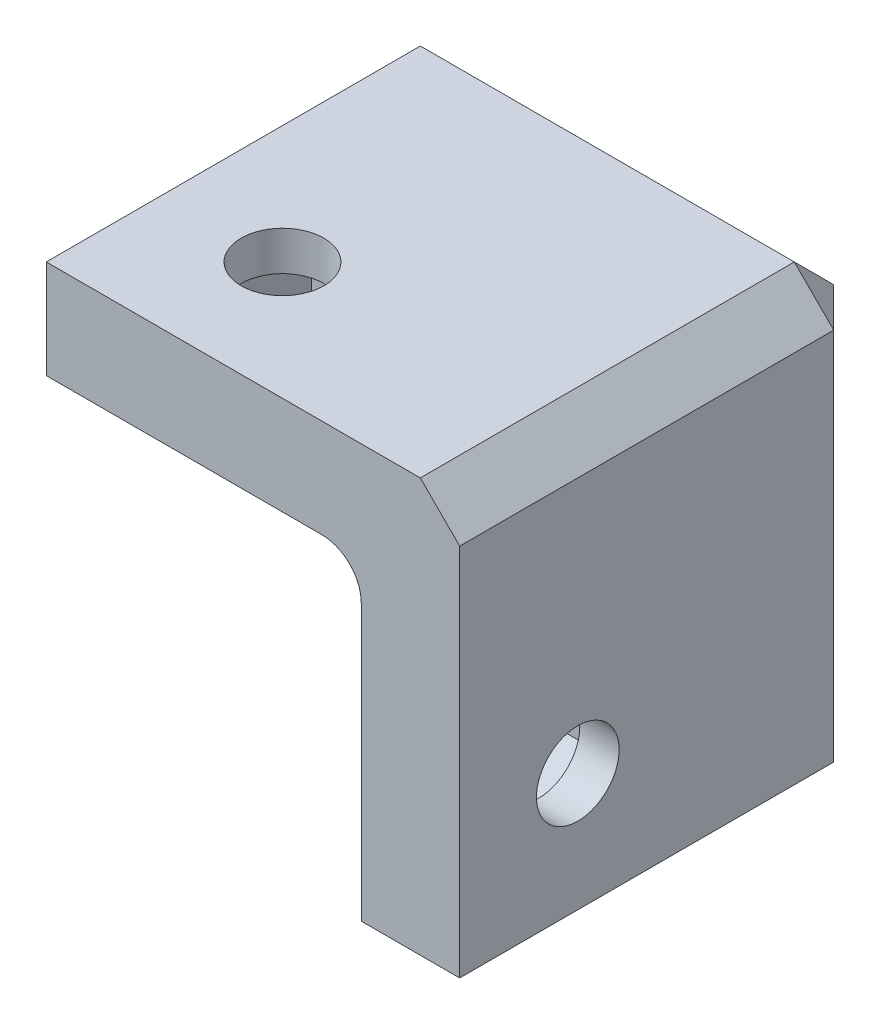
ISO-10303-21;
HEADER;
FILE_DESCRIPTION(('STEP AP214'),'2;1');
FILE_NAME('part.step','',(''),(''),'','','');
FILE_SCHEMA(('AUTOMOTIVE_DESIGN { 1 0 10303 214 1 1 1 1 }'));
ENDSEC;
DATA;
#1=APPLICATION_CONTEXT('core data for automotive mechanical design processes');
#2=APPLICATION_PROTOCOL_DEFINITION('international standard','automotive_design',2000,#1);
#3=PRODUCT_CONTEXT('',#1,'mechanical');
#4=PRODUCT('Part','Part','',(#3));
#5=PRODUCT_RELATED_PRODUCT_CATEGORY('part','',(#4));
#6=PRODUCT_DEFINITION_FORMATION('','',#4);
#7=PRODUCT_DEFINITION_CONTEXT('part definition',#1,'design');
#8=PRODUCT_DEFINITION('design','',#6,#7);
#9=PRODUCT_DEFINITION_SHAPE('','',#8);
#10=(LENGTH_UNIT() NAMED_UNIT(*) SI_UNIT(.MILLI.,.METRE.));
#11=(NAMED_UNIT(*) PLANE_ANGLE_UNIT() SI_UNIT($,.RADIAN.));
#12=(NAMED_UNIT(*) SI_UNIT($,.STERADIAN.) SOLID_ANGLE_UNIT());
#13=UNCERTAINTY_MEASURE_WITH_UNIT(LENGTH_MEASURE(1.E-05),#10,'distance_accuracy_value','');
#14=(GEOMETRIC_REPRESENTATION_CONTEXT(3) GLOBAL_UNCERTAINTY_ASSIGNED_CONTEXT((#13)) GLOBAL_UNIT_ASSIGNED_CONTEXT((#10,
#11,#12)) REPRESENTATION_CONTEXT('',''));
#15=CARTESIAN_POINT('',(0.,0.,0.));
#16=DIRECTION('',(0.,0.,1.));
#17=DIRECTION('',(1.,0.,0.));
#18=AXIS2_PLACEMENT_3D('',#15,#16,#17);
#19=CARTESIAN_POINT('',(6.,18.,15.));
#20=DIRECTION('',(0.,1.,0.));
#21=DIRECTION('',(0.,0.,1.));
#22=AXIS2_PLACEMENT_3D('',#19,#20,#21);
#23=CYLINDRICAL_SURFACE('',#22,2.1);
#24=CARTESIAN_POINT('',(6.,21.,15.));
#25=DIRECTION('',(0.,1.,0.));
#26=DIRECTION('',(0.,0.,1.));
#27=AXIS2_PLACEMENT_3D('',#24,#25,#26);
#28=CIRCLE('',#27,2.1);
#29=CARTESIAN_POINT('',(6.,21.,17.1));
#30=VERTEX_POINT('',#29);
#31=EDGE_CURVE('E397',#30,#30,#28,.T.);
#32=ORIENTED_EDGE('',*,*,#31,.T.);
#33=EDGE_LOOP('',(#32));
#34=FACE_BOUND('',#33,.T.);
#35=CARTESIAN_POINT('',(6.,19.,15.));
#36=DIRECTION('',(0.,-1.,0.));
#37=DIRECTION('',(0.,0.,-1.));
#38=AXIS2_PLACEMENT_3D('',#35,#36,#37);
#39=CIRCLE('',#38,2.1);
#40=CARTESIAN_POINT('',(6.,19.,12.9));
#41=VERTEX_POINT('',#40);
#42=EDGE_CURVE('E285',#41,#41,#39,.F.);
#43=ORIENTED_EDGE('',*,*,#42,.F.);
#44=EDGE_LOOP('',(#43));
#45=FACE_BOUND('',#44,.T.);
#46=ADVANCED_FACE('F34',(#34,#45),#23,.F.);
#47=CARTESIAN_POINT('',(6.,6.,3.));
#48=DIRECTION('',(0.,0.,-1.));
#49=DIRECTION('',(-1.,0.,0.));
#50=AXIS2_PLACEMENT_3D('',#47,#48,#49);
#51=CYLINDRICAL_SURFACE('',#50,2.1);
#52=CARTESIAN_POINT('',(6.,6.,0.));
#53=DIRECTION('',(0.,0.,-1.));
#54=DIRECTION('',(-1.,0.,0.));
#55=AXIS2_PLACEMENT_3D('',#52,#53,#54);
#56=CIRCLE('',#55,2.1);
#57=CARTESIAN_POINT('',(3.9,6.,0.));
#58=VERTEX_POINT('',#57);
#59=EDGE_CURVE('E391',#58,#58,#56,.T.);
#60=ORIENTED_EDGE('',*,*,#59,.T.);
#61=EDGE_LOOP('',(#60));
#62=FACE_BOUND('',#61,.T.);
#63=CARTESIAN_POINT('',(6.,6.,2.));
#64=DIRECTION('',(0.,0.,1.));
#65=DIRECTION('',(1.,0.,0.));
#66=AXIS2_PLACEMENT_3D('',#63,#64,#65);
#67=CIRCLE('',#66,2.1);
#68=CARTESIAN_POINT('',(8.1,6.,2.));
#69=VERTEX_POINT('',#68);
#70=EDGE_CURVE('E331',#69,#69,#67,.F.);
#71=ORIENTED_EDGE('',*,*,#70,.F.);
#72=EDGE_LOOP('',(#71));
#73=FACE_BOUND('',#72,.T.);
#74=ADVANCED_FACE('F544',(#62,#73),#51,.F.);
#75=CARTESIAN_POINT('',(18.,6.,15.));
#76=DIRECTION('',(1.,0.,0.));
#77=DIRECTION('',(0.,0.,-1.));
#78=AXIS2_PLACEMENT_3D('',#75,#76,#77);
#79=CYLINDRICAL_SURFACE('',#78,2.1);
#80=CARTESIAN_POINT('',(21.,6.,15.));
#81=DIRECTION('',(1.,0.,0.));
#82=DIRECTION('',(0.,0.,-1.));
#83=AXIS2_PLACEMENT_3D('',#80,#81,#82);
#84=CIRCLE('',#83,2.1);
#85=CARTESIAN_POINT('',(21.,6.,12.9));
#86=VERTEX_POINT('',#85);
#87=EDGE_CURVE('E394',#86,#86,#84,.T.);
#88=ORIENTED_EDGE('',*,*,#87,.T.);
#89=EDGE_LOOP('',(#88));
#90=FACE_BOUND('',#89,.T.);
#91=CARTESIAN_POINT('',(19.,6.,15.));
#92=DIRECTION('',(-1.,0.,0.));
#93=DIRECTION('',(0.,0.,1.));
#94=AXIS2_PLACEMENT_3D('',#91,#92,#93);
#95=CIRCLE('',#94,2.1);
#96=CARTESIAN_POINT('',(19.,6.,17.1));
#97=VERTEX_POINT('',#96);
#98=EDGE_CURVE('E380',#97,#97,#95,.F.);
#99=ORIENTED_EDGE('',*,*,#98,.F.);
#100=EDGE_LOOP('',(#99));
#101=FACE_BOUND('',#100,.T.);
#102=ADVANCED_FACE('F550',(#90,#101),#79,.F.);
#103=CARTESIAN_POINT('',(0.,0.,5.));
#104=DIRECTION('',(0.,0.,-1.));
#105=DIRECTION('',(-1.,0.,0.));
#106=AXIS2_PLACEMENT_3D('',#103,#104,#105);
#107=PLANE('',#106);
#108=DIRECTION('',(0.,1.,0.));
#109=VECTOR('',#108,1.);
#110=CARTESIAN_POINT('',(9.50000000000001,3.97927405783631,5.));
#111=LINE('',#110,#109);
#112=CARTESIAN_POINT('',(9.50000000000001,3.97927405783631,5.));
#113=VERTEX_POINT('',#112);
#114=CARTESIAN_POINT('',(9.50000000000001,8.0207259421637,5.));
#115=VERTEX_POINT('',#114);
#116=EDGE_CURVE('E315',#113,#115,#111,.T.);
#117=ORIENTED_EDGE('',*,*,#116,.F.);
#118=DIRECTION('',(0.866025403784439,0.5,0.));
#119=VECTOR('',#118,1.);
#120=CARTESIAN_POINT('',(6.00000000000001,1.95854811567261,5.));
#121=LINE('',#120,#119);
#122=CARTESIAN_POINT('',(6.00000000000001,1.95854811567261,5.));
#123=VERTEX_POINT('',#122);
#124=EDGE_CURVE('E313',#123,#113,#121,.T.);
#125=ORIENTED_EDGE('',*,*,#124,.F.);
#126=DIRECTION('',(0.866025403784438,-0.5,0.));
#127=VECTOR('',#126,1.);
#128=CARTESIAN_POINT('',(2.5,3.97927405783631,5.));
#129=LINE('',#128,#127);
#130=CARTESIAN_POINT('',(2.5,3.97927405783631,5.));
#131=VERTEX_POINT('',#130);
#132=EDGE_CURVE('E297',#131,#123,#129,.T.);
#133=ORIENTED_EDGE('',*,*,#132,.F.);
#134=DIRECTION('',(0.,-1.,0.));
#135=VECTOR('',#134,1.);
#136=CARTESIAN_POINT('',(2.5,8.0207259421637,5.));
#137=LINE('',#136,#135);
#138=CARTESIAN_POINT('',(2.5,8.0207259421637,5.));
#139=VERTEX_POINT('',#138);
#140=EDGE_CURVE('E324',#139,#131,#137,.T.);
#141=ORIENTED_EDGE('',*,*,#140,.F.);
#142=DIRECTION('',(-0.866025403784439,-0.499999999999999,0.));
#143=VECTOR('',#142,1.);
#144=CARTESIAN_POINT('',(6.00000000000001,10.0414518843274,5.));
#145=LINE('',#144,#143);
#146=CARTESIAN_POINT('',(6.00000000000001,10.0414518843274,5.));
#147=VERTEX_POINT('',#146);
#148=EDGE_CURVE('E321',#147,#139,#145,.T.);
#149=ORIENTED_EDGE('',*,*,#148,.F.);
#150=DIRECTION('',(-0.866025403784439,0.5,0.));
#151=VECTOR('',#150,1.);
#152=CARTESIAN_POINT('',(9.50000000000001,8.0207259421637,5.));
#153=LINE('',#152,#151);
#154=EDGE_CURVE('E318',#115,#147,#153,.T.);
#155=ORIENTED_EDGE('',*,*,#154,.F.);
#156=EDGE_LOOP('',(#117,#125,#133,#141,#149,#155));
#157=FACE_BOUND('',#156,.T.);
#158=DIRECTION('',(0.,-1.,0.));
#159=VECTOR('',#158,1.);
#160=CARTESIAN_POINT('',(14.,16.,5.));
#161=LINE('',#160,#159);
#162=CARTESIAN_POINT('',(14.,0.,5.));
#163=VERTEX_POINT('',#162);
#164=CARTESIAN_POINT('',(14.,14.,5.));
#165=VERTEX_POINT('',#164);
#166=EDGE_CURVE('E428',#163,#165,#161,.F.);
#167=ORIENTED_EDGE('',*,*,#166,.T.);
#168=DIRECTION('',(1.,0.,0.));
#169=VECTOR('',#168,1.);
#170=CARTESIAN_POINT('',(0.,14.,5.));
#171=LINE('',#170,#169);
#172=CARTESIAN_POINT('',(0.,14.,5.));
#173=VERTEX_POINT('',#172);
#174=EDGE_CURVE('E430',#165,#173,#171,.F.);
#175=ORIENTED_EDGE('',*,*,#174,.T.);
#176=DIRECTION('',(0.,-1.,0.));
#177=VECTOR('',#176,1.);
#178=CARTESIAN_POINT('',(0.,0.,5.));
#179=LINE('',#178,#177);
#180=CARTESIAN_POINT('',(0.,0.,5.));
#181=VERTEX_POINT('',#180);
#182=EDGE_CURVE('E421',#173,#181,#179,.T.);
#183=ORIENTED_EDGE('',*,*,#182,.T.);
#184=DIRECTION('',(1.,0.,0.));
#185=VECTOR('',#184,1.);
#186=CARTESIAN_POINT('',(0.,0.,5.));
#187=LINE('',#186,#185);
#188=EDGE_CURVE('E424',#181,#163,#187,.T.);
#189=ORIENTED_EDGE('',*,*,#188,.T.);
#190=EDGE_LOOP('',(#167,#175,#183,#189));
#191=FACE_BOUND('',#190,.T.);
#192=ADVANCED_FACE('F527',(#157,#191),#107,.F.);
#193=CARTESIAN_POINT('',(0.,0.,5.));
#194=DIRECTION('',(1.,0.,0.));
#195=DIRECTION('',(0.,0.,-1.));
#196=AXIS2_PLACEMENT_3D('',#193,#194,#195);
#197=PLANE('',#196);
#198=DIRECTION('',(0.,0.,-1.));
#199=VECTOR('',#198,1.);
#200=CARTESIAN_POINT('',(0.,21.,5.));
#201=LINE('',#200,#199);
#202=CARTESIAN_POINT('',(0.,21.,21.));
#203=VERTEX_POINT('',#202);
#204=CARTESIAN_POINT('',(0.,21.,2.));
#205=VERTEX_POINT('',#204);
#206=EDGE_CURVE('E508',#203,#205,#201,.T.);
#207=ORIENTED_EDGE('',*,*,#206,.T.);
#208=DIRECTION('',(0.,-0.707106781186548,-0.707106781186547));
#209=VECTOR('',#208,1.);
#210=CARTESIAN_POINT('',(0.,21.,2.));
#211=LINE('',#210,#209);
#212=CARTESIAN_POINT('',(0.,19.,0.));
#213=VERTEX_POINT('',#212);
#214=EDGE_CURVE('E474',#205,#213,#211,.T.);
#215=ORIENTED_EDGE('',*,*,#214,.T.);
#216=DIRECTION('',(0.,-1.,0.));
#217=VECTOR('',#216,1.);
#218=CARTESIAN_POINT('',(0.,0.,0.));
#219=LINE('',#218,#217);
#220=CARTESIAN_POINT('',(0.,0.,0.));
#221=VERTEX_POINT('',#220);
#222=EDGE_CURVE('E505',#213,#221,#219,.T.);
#223=ORIENTED_EDGE('',*,*,#222,.T.);
#224=DIRECTION('',(0.,0.,-1.));
#225=VECTOR('',#224,1.);
#226=CARTESIAN_POINT('',(0.,0.,5.));
#227=LINE('',#226,#225);
#228=EDGE_CURVE('E489',#181,#221,#227,.T.);
#229=ORIENTED_EDGE('',*,*,#228,.F.);
#230=ORIENTED_EDGE('',*,*,#182,.F.);
#231=CARTESIAN_POINT('',(0.,14.,7.));
#232=DIRECTION('',(1.,0.,0.));
#233=DIRECTION('',(0.,0.,-1.));
#234=AXIS2_PLACEMENT_3D('',#231,#232,#233);
#235=CIRCLE('',#234,2.);
#236=CARTESIAN_POINT('',(0.,16.,7.));
#237=VERTEX_POINT('',#236);
#238=EDGE_CURVE('E435',#173,#237,#235,.T.);
#239=ORIENTED_EDGE('',*,*,#238,.T.);
#240=DIRECTION('',(0.,0.,-1.));
#241=VECTOR('',#240,1.);
#242=CARTESIAN_POINT('',(0.,16.,21.));
#243=LINE('',#242,#241);
#244=CARTESIAN_POINT('',(0.,16.,21.));
#245=VERTEX_POINT('',#244);
#246=EDGE_CURVE('E500',#245,#237,#243,.T.);
#247=ORIENTED_EDGE('',*,*,#246,.F.);
#248=DIRECTION('',(0.,-1.,0.));
#249=VECTOR('',#248,1.);
#250=CARTESIAN_POINT('',(0.,21.,21.));
#251=LINE('',#250,#249);
#252=EDGE_CURVE('E400',#203,#245,#251,.T.);
#253=ORIENTED_EDGE('',*,*,#252,.F.);
#254=EDGE_LOOP('',(#207,#215,#223,#229,#230,#239,#247,#253));
#255=FACE_BOUND('',#254,.T.);
#256=ADVANCED_FACE('F518',(#255),#197,.F.);
#257=CARTESIAN_POINT('',(0.,0.,5.));
#258=DIRECTION('',(0.,1.,0.));
#259=DIRECTION('',(0.,0.,1.));
#260=AXIS2_PLACEMENT_3D('',#257,#258,#259);
#261=PLANE('',#260);
#262=DIRECTION('',(1.,0.,0.));
#263=VECTOR('',#262,1.);
#264=CARTESIAN_POINT('',(0.,0.,0.));
#265=LINE('',#264,#263);
#266=CARTESIAN_POINT('',(19.,0.,0.));
#267=VERTEX_POINT('',#266);
#268=EDGE_CURVE('E425',#221,#267,#265,.T.);
#269=ORIENTED_EDGE('',*,*,#268,.T.);
#270=DIRECTION('',(0.707106781186548,0.,0.707106781186547));
#271=VECTOR('',#270,1.);
#272=CARTESIAN_POINT('',(21.,0.,2.));
#273=LINE('',#272,#271);
#274=CARTESIAN_POINT('',(21.,0.,2.));
#275=VERTEX_POINT('',#274);
#276=EDGE_CURVE('E458',#267,#275,#273,.T.);
#277=ORIENTED_EDGE('',*,*,#276,.T.);
#278=DIRECTION('',(0.,0.,-1.));
#279=VECTOR('',#278,1.);
#280=CARTESIAN_POINT('',(21.,0.,5.));
#281=LINE('',#280,#279);
#282=CARTESIAN_POINT('',(21.,0.,21.));
#283=VERTEX_POINT('',#282);
#284=EDGE_CURVE('E511',#283,#275,#281,.T.);
#285=ORIENTED_EDGE('',*,*,#284,.F.);
#286=DIRECTION('',(1.,0.,0.));
#287=VECTOR('',#286,1.);
#288=CARTESIAN_POINT('',(21.,0.,21.));
#289=LINE('',#288,#287);
#290=CARTESIAN_POINT('',(16.,0.,21.));
#291=VERTEX_POINT('',#290);
#292=EDGE_CURVE('E407',#291,#283,#289,.T.);
#293=ORIENTED_EDGE('',*,*,#292,.F.);
#294=DIRECTION('',(0.,0.,-1.));
#295=VECTOR('',#294,1.);
#296=CARTESIAN_POINT('',(16.,0.,21.));
#297=LINE('',#296,#295);
#298=CARTESIAN_POINT('',(16.,0.,7.));
#299=VERTEX_POINT('',#298);
#300=EDGE_CURVE('E415',#291,#299,#297,.T.);
#301=ORIENTED_EDGE('',*,*,#300,.T.);
#302=CARTESIAN_POINT('',(14.,0.,7.));
#303=DIRECTION('',(0.,1.,0.));
#304=DIRECTION('',(0.,0.,1.));
#305=AXIS2_PLACEMENT_3D('',#302,#303,#304);
#306=CIRCLE('',#305,2.);
#307=EDGE_CURVE('E43',#299,#163,#306,.T.);
#308=ORIENTED_EDGE('',*,*,#307,.T.);
#309=ORIENTED_EDGE('',*,*,#188,.F.);
#310=ORIENTED_EDGE('',*,*,#228,.T.);
#311=EDGE_LOOP('',(#269,#277,#285,#293,#301,#308,#309,#310));
#312=FACE_BOUND('',#311,.T.);
#313=ADVANCED_FACE('F523',(#312),#261,.F.);
#314=CARTESIAN_POINT('',(21.,0.,5.));
#315=DIRECTION('',(-1.,0.,0.));
#316=DIRECTION('',(0.,0.,1.));
#317=AXIS2_PLACEMENT_3D('',#314,#315,#316);
#318=PLANE('',#317);
#319=ORIENTED_EDGE('',*,*,#87,.F.);
#320=EDGE_LOOP('',(#319));
#321=FACE_BOUND('',#320,.T.);
#322=DIRECTION('',(0.,1.,0.));
#323=VECTOR('',#322,1.);
#324=CARTESIAN_POINT('',(21.,21.,2.));
#325=LINE('',#324,#323);
#326=CARTESIAN_POINT('',(21.,19.,2.));
#327=VERTEX_POINT('',#326);
#328=EDGE_CURVE('E482',#275,#327,#325,.T.);
#329=ORIENTED_EDGE('',*,*,#328,.T.);
#330=DIRECTION('',(0.,0.,1.));
#331=VECTOR('',#330,1.);
#332=CARTESIAN_POINT('',(21.,19.,5.));
#333=LINE('',#332,#331);
#334=CARTESIAN_POINT('',(21.,19.,21.));
#335=VERTEX_POINT('',#334);
#336=EDGE_CURVE('E480',#327,#335,#333,.T.);
#337=ORIENTED_EDGE('',*,*,#336,.T.);
#338=DIRECTION('',(0.,1.,0.));
#339=VECTOR('',#338,1.);
#340=CARTESIAN_POINT('',(21.,21.,21.));
#341=LINE('',#340,#339);
#342=EDGE_CURVE('E410',#283,#335,#341,.T.);
#343=ORIENTED_EDGE('',*,*,#342,.F.);
#344=ORIENTED_EDGE('',*,*,#284,.T.);
#345=EDGE_LOOP('',(#329,#337,#343,#344));
#346=FACE_BOUND('',#345,.T.);
#347=ADVANCED_FACE('F577',(#321,#346),#318,.F.);
#348=CARTESIAN_POINT('',(0.,21.,5.));
#349=DIRECTION('',(0.,-1.,0.));
#350=DIRECTION('',(0.,0.,-1.));
#351=AXIS2_PLACEMENT_3D('',#348,#349,#350);
#352=PLANE('',#351);
#353=ORIENTED_EDGE('',*,*,#31,.F.);
#354=EDGE_LOOP('',(#353));
#355=FACE_BOUND('',#354,.T.);
#356=DIRECTION('',(-1.,0.,0.));
#357=VECTOR('',#356,1.);
#358=CARTESIAN_POINT('',(0.,21.,21.));
#359=LINE('',#358,#357);
#360=CARTESIAN_POINT('',(19.,21.,21.));
#361=VERTEX_POINT('',#360);
#362=EDGE_CURVE('E413',#361,#203,#359,.T.);
#363=ORIENTED_EDGE('',*,*,#362,.F.);
#364=DIRECTION('',(0.,0.,-1.));
#365=VECTOR('',#364,1.);
#366=CARTESIAN_POINT('',(19.,21.,5.));
#367=LINE('',#366,#365);
#368=CARTESIAN_POINT('',(19.,21.,2.));
#369=VERTEX_POINT('',#368);
#370=EDGE_CURVE('E484',#361,#369,#367,.T.);
#371=ORIENTED_EDGE('',*,*,#370,.T.);
#372=DIRECTION('',(-1.,0.,0.));
#373=VECTOR('',#372,1.);
#374=CARTESIAN_POINT('',(0.,21.,2.));
#375=LINE('',#374,#373);
#376=EDGE_CURVE('E487',#369,#205,#375,.T.);
#377=ORIENTED_EDGE('',*,*,#376,.T.);
#378=ORIENTED_EDGE('',*,*,#206,.F.);
#379=EDGE_LOOP('',(#363,#371,#377,#378));
#380=FACE_BOUND('',#379,.T.);
#381=ADVANCED_FACE('F573',(#355,#380),#352,.F.);
#382=CARTESIAN_POINT('',(0.,0.,0.));
#383=DIRECTION('',(0.,0.,-1.));
#384=DIRECTION('',(-1.,0.,0.));
#385=AXIS2_PLACEMENT_3D('',#382,#383,#384);
#386=PLANE('',#385);
#387=ORIENTED_EDGE('',*,*,#59,.F.);
#388=EDGE_LOOP('',(#387));
#389=FACE_BOUND('',#388,.T.);
#390=ORIENTED_EDGE('',*,*,#222,.F.);
#391=DIRECTION('',(1.,0.,0.));
#392=VECTOR('',#391,1.);
#393=CARTESIAN_POINT('',(21.,19.,0.));
#394=LINE('',#393,#392);
#395=CARTESIAN_POINT('',(19.,19.,0.));
#396=VERTEX_POINT('',#395);
#397=EDGE_CURVE('E464',#213,#396,#394,.T.);
#398=ORIENTED_EDGE('',*,*,#397,.T.);
#399=DIRECTION('',(0.,-1.,0.));
#400=VECTOR('',#399,1.);
#401=CARTESIAN_POINT('',(19.,0.,0.));
#402=LINE('',#401,#400);
#403=EDGE_CURVE('E469',#396,#267,#402,.T.);
#404=ORIENTED_EDGE('',*,*,#403,.T.);
#405=ORIENTED_EDGE('',*,*,#268,.F.);
#406=EDGE_LOOP('',(#390,#398,#404,#405));
#407=FACE_BOUND('',#406,.T.);
#408=ADVANCED_FACE('F521',(#389,#407),#386,.T.);
#409=CARTESIAN_POINT('',(0.,16.,21.));
#410=DIRECTION('',(0.,1.,0.));
#411=DIRECTION('',(0.,0.,1.));
#412=AXIS2_PLACEMENT_3D('',#409,#410,#411);
#413=PLANE('',#412);
#414=DIRECTION('',(0.5,0.,0.866025403784438));
#415=VECTOR('',#414,1.);
#416=CARTESIAN_POINT('',(8.0207259421637,16.,11.5));
#417=LINE('',#416,#415);
#418=CARTESIAN_POINT('',(8.0207259421637,16.,11.5));
#419=VERTEX_POINT('',#418);
#420=CARTESIAN_POINT('',(10.0414518843274,16.,15.));
#421=VERTEX_POINT('',#420);
#422=EDGE_CURVE('E272',#419,#421,#417,.T.);
#423=ORIENTED_EDGE('',*,*,#422,.F.);
#424=DIRECTION('',(1.,0.,0.));
#425=VECTOR('',#424,1.);
#426=CARTESIAN_POINT('',(3.97927405783632,16.,11.5));
#427=LINE('',#426,#425);
#428=CARTESIAN_POINT('',(3.97927405783632,16.,11.5));
#429=VERTEX_POINT('',#428);
#430=EDGE_CURVE('E239',#429,#419,#427,.T.);
#431=ORIENTED_EDGE('',*,*,#430,.F.);
#432=DIRECTION('',(0.499999999999999,0.,-0.866025403784439));
#433=VECTOR('',#432,1.);
#434=CARTESIAN_POINT('',(1.95854811567262,16.,15.));
#435=LINE('',#434,#433);
#436=CARTESIAN_POINT('',(1.95854811567262,16.,15.));
#437=VERTEX_POINT('',#436);
#438=EDGE_CURVE('E258',#437,#429,#435,.T.);
#439=ORIENTED_EDGE('',*,*,#438,.F.);
#440=DIRECTION('',(-0.5,0.,-0.866025403784438));
#441=VECTOR('',#440,1.);
#442=CARTESIAN_POINT('',(3.97927405783632,16.,18.5));
#443=LINE('',#442,#441);
#444=CARTESIAN_POINT('',(3.97927405783632,16.,18.5));
#445=VERTEX_POINT('',#444);
#446=EDGE_CURVE('E261',#445,#437,#443,.T.);
#447=ORIENTED_EDGE('',*,*,#446,.F.);
#448=DIRECTION('',(-1.,0.,0.));
#449=VECTOR('',#448,1.);
#450=CARTESIAN_POINT('',(8.0207259421637,16.,18.5));
#451=LINE('',#450,#449);
#452=CARTESIAN_POINT('',(8.0207259421637,16.,18.5));
#453=VERTEX_POINT('',#452);
#454=EDGE_CURVE('E278',#453,#445,#451,.T.);
#455=ORIENTED_EDGE('',*,*,#454,.F.);
#456=DIRECTION('',(-0.499999999999999,0.,0.866025403784439));
#457=VECTOR('',#456,1.);
#458=CARTESIAN_POINT('',(10.0414518843274,16.,15.));
#459=LINE('',#458,#457);
#460=EDGE_CURVE('E275',#421,#453,#459,.T.);
#461=ORIENTED_EDGE('',*,*,#460,.F.);
#462=EDGE_LOOP('',(#423,#431,#439,#447,#455,#461));
#463=FACE_BOUND('',#462,.T.);
#464=ORIENTED_EDGE('',*,*,#246,.T.);
#465=DIRECTION('',(1.,0.,0.));
#466=VECTOR('',#465,1.);
#467=CARTESIAN_POINT('',(16.,16.,7.));
#468=LINE('',#467,#466);
#469=CARTESIAN_POINT('',(14.,16.,7.));
#470=VERTEX_POINT('',#469);
#471=EDGE_CURVE('E426',#237,#470,#468,.T.);
#472=ORIENTED_EDGE('',*,*,#471,.T.);
#473=DIRECTION('',(0.,0.,-1.));
#474=VECTOR('',#473,1.);
#475=CARTESIAN_POINT('',(14.,16.,21.));
#476=LINE('',#475,#474);
#477=CARTESIAN_POINT('',(14.,16.,21.));
#478=VERTEX_POINT('',#477);
#479=EDGE_CURVE('E461',#470,#478,#476,.F.);
#480=ORIENTED_EDGE('',*,*,#479,.T.);
#481=DIRECTION('',(1.,0.,0.));
#482=VECTOR('',#481,1.);
#483=CARTESIAN_POINT('',(0.,16.,21.));
#484=LINE('',#483,#482);
#485=EDGE_CURVE('E403',#245,#478,#484,.T.);
#486=ORIENTED_EDGE('',*,*,#485,.F.);
#487=EDGE_LOOP('',(#464,#472,#480,#486));
#488=FACE_BOUND('',#487,.T.);
#489=ADVANCED_FACE('F563',(#463,#488),#413,.F.);
#490=CARTESIAN_POINT('',(16.,16.,21.));
#491=DIRECTION('',(1.,0.,0.));
#492=DIRECTION('',(0.,1.,0.));
#493=AXIS2_PLACEMENT_3D('',#490,#491,#492);
#494=PLANE('',#493);
#495=DIRECTION('',(0.,1.,0.));
#496=VECTOR('',#495,1.);
#497=CARTESIAN_POINT('',(16.,3.97927405783631,18.5));
#498=LINE('',#497,#496);
#499=CARTESIAN_POINT('',(16.,3.97927405783631,18.5));
#500=VERTEX_POINT('',#499);
#501=CARTESIAN_POINT('',(16.,8.0207259421637,18.5));
#502=VERTEX_POINT('',#501);
#503=EDGE_CURVE('E364',#500,#502,#498,.T.);
#504=ORIENTED_EDGE('',*,*,#503,.F.);
#505=DIRECTION('',(0.,0.5,0.866025403784439));
#506=VECTOR('',#505,1.);
#507=CARTESIAN_POINT('',(16.,1.95854811567262,15.));
#508=LINE('',#507,#506);
#509=CARTESIAN_POINT('',(16.,1.95854811567262,15.));
#510=VERTEX_POINT('',#509);
#511=EDGE_CURVE('E362',#510,#500,#508,.T.);
#512=ORIENTED_EDGE('',*,*,#511,.F.);
#513=DIRECTION('',(0.,-0.500000000000001,0.866025403784438));
#514=VECTOR('',#513,1.);
#515=CARTESIAN_POINT('',(16.,3.97927405783631,11.5));
#516=LINE('',#515,#514);
#517=CARTESIAN_POINT('',(16.,3.97927405783631,11.5));
#518=VERTEX_POINT('',#517);
#519=EDGE_CURVE('E346',#518,#510,#516,.T.);
#520=ORIENTED_EDGE('',*,*,#519,.F.);
#521=DIRECTION('',(0.,-1.,0.));
#522=VECTOR('',#521,1.);
#523=CARTESIAN_POINT('',(16.,8.0207259421637,11.5));
#524=LINE('',#523,#522);
#525=CARTESIAN_POINT('',(16.,8.0207259421637,11.5));
#526=VERTEX_POINT('',#525);
#527=EDGE_CURVE('E373',#526,#518,#524,.T.);
#528=ORIENTED_EDGE('',*,*,#527,.F.);
#529=DIRECTION('',(0.,-0.499999999999999,-0.866025403784439));
#530=VECTOR('',#529,1.);
#531=CARTESIAN_POINT('',(16.,10.0414518843274,15.));
#532=LINE('',#531,#530);
#533=CARTESIAN_POINT('',(16.,10.0414518843274,15.));
#534=VERTEX_POINT('',#533);
#535=EDGE_CURVE('E370',#534,#526,#532,.T.);
#536=ORIENTED_EDGE('',*,*,#535,.F.);
#537=DIRECTION('',(0.,0.5,-0.866025403784439));
#538=VECTOR('',#537,1.);
#539=CARTESIAN_POINT('',(16.,8.0207259421637,18.5));
#540=LINE('',#539,#538);
#541=EDGE_CURVE('E367',#502,#534,#540,.T.);
#542=ORIENTED_EDGE('',*,*,#541,.F.);
#543=EDGE_LOOP('',(#504,#512,#520,#528,#536,#542));
#544=FACE_BOUND('',#543,.T.);
#545=DIRECTION('',(0.,0.,-1.));
#546=VECTOR('',#545,1.);
#547=CARTESIAN_POINT('',(16.,14.,5.));
#548=LINE('',#547,#546);
#549=CARTESIAN_POINT('',(16.,14.,21.));
#550=VERTEX_POINT('',#549);
#551=CARTESIAN_POINT('',(16.,14.,7.));
#552=VERTEX_POINT('',#551);
#553=EDGE_CURVE('E51',#550,#552,#548,.T.);
#554=ORIENTED_EDGE('',*,*,#553,.T.);
#555=DIRECTION('',(0.,-1.,0.));
#556=VECTOR('',#555,1.);
#557=CARTESIAN_POINT('',(16.,0.,7.));
#558=LINE('',#557,#556);
#559=EDGE_CURVE('E433',#552,#299,#558,.T.);
#560=ORIENTED_EDGE('',*,*,#559,.T.);
#561=ORIENTED_EDGE('',*,*,#300,.F.);
#562=DIRECTION('',(0.,-1.,0.));
#563=VECTOR('',#562,1.);
#564=CARTESIAN_POINT('',(16.,16.,21.));
#565=LINE('',#564,#563);
#566=EDGE_CURVE('E405',#550,#291,#565,.T.);
#567=ORIENTED_EDGE('',*,*,#566,.F.);
#568=EDGE_LOOP('',(#554,#560,#561,#567));
#569=FACE_BOUND('',#568,.T.);
#570=ADVANCED_FACE('F560',(#544,#569),#494,.F.);
#571=CARTESIAN_POINT('',(0.,0.,21.));
#572=DIRECTION('',(0.,0.,1.));
#573=DIRECTION('',(1.,0.,0.));
#574=AXIS2_PLACEMENT_3D('',#571,#572,#573);
#575=PLANE('',#574);
#576=ORIENTED_EDGE('',*,*,#342,.T.);
#577=DIRECTION('',(0.707106781186548,-0.707106781186547,0.));
#578=VECTOR('',#577,1.);
#579=CARTESIAN_POINT('',(20.,20.,21.));
#580=LINE('',#579,#578);
#581=EDGE_CURVE('E478',#335,#361,#580,.F.);
#582=ORIENTED_EDGE('',*,*,#581,.T.);
#583=ORIENTED_EDGE('',*,*,#362,.T.);
#584=ORIENTED_EDGE('',*,*,#252,.T.);
#585=ORIENTED_EDGE('',*,*,#485,.T.);
#586=CARTESIAN_POINT('',(14.,14.,21.));
#587=DIRECTION('',(0.,0.,1.));
#588=DIRECTION('',(1.,0.,0.));
#589=AXIS2_PLACEMENT_3D('',#586,#587,#588);
#590=CIRCLE('',#589,2.);
#591=EDGE_CURVE('E11',#478,#550,#590,.F.);
#592=ORIENTED_EDGE('',*,*,#591,.T.);
#593=ORIENTED_EDGE('',*,*,#566,.T.);
#594=ORIENTED_EDGE('',*,*,#292,.T.);
#595=EDGE_LOOP('',(#576,#582,#583,#584,#585,#592,#593,#594));
#596=FACE_BOUND('',#595,.T.);
#597=ADVANCED_FACE('F556',(#596),#575,.T.);
#598=CARTESIAN_POINT('',(19.,0.,0.));
#599=DIRECTION('',(-1.,0.,0.));
#600=DIRECTION('',(0.,0.,1.));
#601=AXIS2_PLACEMENT_3D('',#598,#599,#600);
#602=PLANE('',#601);
#603=DIRECTION('',(0.,0.5,0.866025403784439));
#604=VECTOR('',#603,1.);
#605=CARTESIAN_POINT('',(19.,1.95854811567262,15.));
#606=LINE('',#605,#604);
#607=CARTESIAN_POINT('',(19.,1.95854811567262,15.));
#608=VERTEX_POINT('',#607);
#609=CARTESIAN_POINT('',(19.,3.97927405783631,18.5));
#610=VERTEX_POINT('',#609);
#611=EDGE_CURVE('E342',#608,#610,#606,.T.);
#612=ORIENTED_EDGE('',*,*,#611,.T.);
#613=DIRECTION('',(0.,1.,0.));
#614=VECTOR('',#613,1.);
#615=CARTESIAN_POINT('',(19.,3.97927405783631,18.5));
#616=LINE('',#615,#614);
#617=CARTESIAN_POINT('',(19.,8.0207259421637,18.5));
#618=VERTEX_POINT('',#617);
#619=EDGE_CURVE('E345',#610,#618,#616,.T.);
#620=ORIENTED_EDGE('',*,*,#619,.T.);
#621=DIRECTION('',(0.,0.5,-0.866025403784439));
#622=VECTOR('',#621,1.);
#623=CARTESIAN_POINT('',(19.,8.0207259421637,18.5));
#624=LINE('',#623,#622);
#625=CARTESIAN_POINT('',(19.,10.0414518843274,15.));
#626=VERTEX_POINT('',#625);
#627=EDGE_CURVE('E349',#618,#626,#624,.T.);
#628=ORIENTED_EDGE('',*,*,#627,.T.);
#629=DIRECTION('',(0.,-0.499999999999999,-0.866025403784439));
#630=VECTOR('',#629,1.);
#631=CARTESIAN_POINT('',(19.,10.0414518843274,15.));
#632=LINE('',#631,#630);
#633=CARTESIAN_POINT('',(19.,8.0207259421637,11.5));
#634=VERTEX_POINT('',#633);
#635=EDGE_CURVE('E352',#626,#634,#632,.T.);
#636=ORIENTED_EDGE('',*,*,#635,.T.);
#637=DIRECTION('',(0.,-1.,0.));
#638=VECTOR('',#637,1.);
#639=CARTESIAN_POINT('',(19.,8.0207259421637,11.5));
#640=LINE('',#639,#638);
#641=CARTESIAN_POINT('',(19.,3.97927405783631,11.5));
#642=VERTEX_POINT('',#641);
#643=EDGE_CURVE('E355',#634,#642,#640,.T.);
#644=ORIENTED_EDGE('',*,*,#643,.T.);
#645=DIRECTION('',(0.,-0.500000000000001,0.866025403784438));
#646=VECTOR('',#645,1.);
#647=CARTESIAN_POINT('',(19.,3.97927405783631,11.5));
#648=LINE('',#647,#646);
#649=EDGE_CURVE('E358',#642,#608,#648,.T.);
#650=ORIENTED_EDGE('',*,*,#649,.T.);
#651=EDGE_LOOP('',(#612,#620,#628,#636,#644,#650));
#652=FACE_BOUND('',#651,.T.);
#653=ORIENTED_EDGE('',*,*,#98,.T.);
#654=EDGE_LOOP('',(#653));
#655=FACE_BOUND('',#654,.T.);
#656=ADVANCED_FACE('F559',(#652,#655),#602,.T.);
#657=CARTESIAN_POINT('',(19.,1.95854811567262,15.));
#658=DIRECTION('',(0.,-0.866025403784439,0.5));
#659=DIRECTION('',(0.,-0.5,-0.866025403784439));
#660=AXIS2_PLACEMENT_3D('',#657,#658,#659);
#661=PLANE('',#660);
#662=ORIENTED_EDGE('',*,*,#511,.T.);
#663=DIRECTION('',(-1.,0.,0.));
#664=VECTOR('',#663,1.);
#665=CARTESIAN_POINT('',(19.,3.97927405783631,18.5));
#666=LINE('',#665,#664);
#667=EDGE_CURVE('E361',#610,#500,#666,.T.);
#668=ORIENTED_EDGE('',*,*,#667,.F.);
#669=ORIENTED_EDGE('',*,*,#611,.F.);
#670=DIRECTION('',(-1.,0.,0.));
#671=VECTOR('',#670,1.);
#672=CARTESIAN_POINT('',(19.,1.95854811567262,15.));
#673=LINE('',#672,#671);
#674=EDGE_CURVE('E378',#608,#510,#673,.T.);
#675=ORIENTED_EDGE('',*,*,#674,.T.);
#676=EDGE_LOOP('',(#662,#668,#669,#675));
#677=FACE_BOUND('',#676,.T.);
#678=ADVANCED_FACE('F836',(#677),#661,.F.);
#679=CARTESIAN_POINT('',(19.,3.97927405783631,11.5));
#680=DIRECTION('',(0.,-0.866025403784438,-0.500000000000001));
#681=DIRECTION('',(0.,0.500000000000001,-0.866025403784438));
#682=AXIS2_PLACEMENT_3D('',#679,#680,#681);
#683=PLANE('',#682);
#684=ORIENTED_EDGE('',*,*,#519,.T.);
#685=ORIENTED_EDGE('',*,*,#674,.F.);
#686=ORIENTED_EDGE('',*,*,#649,.F.);
#687=DIRECTION('',(-1.,0.,0.));
#688=VECTOR('',#687,1.);
#689=CARTESIAN_POINT('',(19.,3.97927405783631,11.5));
#690=LINE('',#689,#688);
#691=EDGE_CURVE('E381',#642,#518,#690,.T.);
#692=ORIENTED_EDGE('',*,*,#691,.T.);
#693=EDGE_LOOP('',(#684,#685,#686,#692));
#694=FACE_BOUND('',#693,.T.);
#695=ADVANCED_FACE('F827',(#694),#683,.F.);
#696=CARTESIAN_POINT('',(19.,8.0207259421637,11.5));
#697=DIRECTION('',(0.,0.,-1.));
#698=DIRECTION('',(0.,1.,0.));
#699=AXIS2_PLACEMENT_3D('',#696,#697,#698);
#700=PLANE('',#699);
#701=ORIENTED_EDGE('',*,*,#527,.T.);
#702=ORIENTED_EDGE('',*,*,#691,.F.);
#703=ORIENTED_EDGE('',*,*,#643,.F.);
#704=DIRECTION('',(-1.,0.,0.));
#705=VECTOR('',#704,1.);
#706=CARTESIAN_POINT('',(19.,8.0207259421637,11.5));
#707=LINE('',#706,#705);
#708=EDGE_CURVE('E383',#634,#526,#707,.T.);
#709=ORIENTED_EDGE('',*,*,#708,.T.);
#710=EDGE_LOOP('',(#701,#702,#703,#709));
#711=FACE_BOUND('',#710,.T.);
#712=ADVANCED_FACE('F818',(#711),#700,.F.);
#713=CARTESIAN_POINT('',(19.,10.0414518843274,15.));
#714=DIRECTION('',(0.,0.866025403784439,-0.499999999999999));
#715=DIRECTION('',(0.,0.499999999999999,0.866025403784439));
#716=AXIS2_PLACEMENT_3D('',#713,#714,#715);
#717=PLANE('',#716);
#718=ORIENTED_EDGE('',*,*,#535,.T.);
#719=ORIENTED_EDGE('',*,*,#708,.F.);
#720=ORIENTED_EDGE('',*,*,#635,.F.);
#721=DIRECTION('',(-1.,0.,0.));
#722=VECTOR('',#721,1.);
#723=CARTESIAN_POINT('',(19.,10.0414518843274,15.));
#724=LINE('',#723,#722);
#725=EDGE_CURVE('E385',#626,#534,#724,.T.);
#726=ORIENTED_EDGE('',*,*,#725,.T.);
#727=EDGE_LOOP('',(#718,#719,#720,#726));
#728=FACE_BOUND('',#727,.T.);
#729=ADVANCED_FACE('F809',(#728),#717,.F.);
#730=CARTESIAN_POINT('',(19.,8.0207259421637,18.5));
#731=DIRECTION('',(0.,0.866025403784439,0.5));
#732=DIRECTION('',(0.,-0.5,0.866025403784439));
#733=AXIS2_PLACEMENT_3D('',#730,#731,#732);
#734=PLANE('',#733);
#735=ORIENTED_EDGE('',*,*,#541,.T.);
#736=ORIENTED_EDGE('',*,*,#725,.F.);
#737=ORIENTED_EDGE('',*,*,#627,.F.);
#738=DIRECTION('',(-1.,0.,0.));
#739=VECTOR('',#738,1.);
#740=CARTESIAN_POINT('',(19.,8.0207259421637,18.5));
#741=LINE('',#740,#739);
#742=EDGE_CURVE('E387',#618,#502,#741,.T.);
#743=ORIENTED_EDGE('',*,*,#742,.T.);
#744=EDGE_LOOP('',(#735,#736,#737,#743));
#745=FACE_BOUND('',#744,.T.);
#746=ADVANCED_FACE('F800',(#745),#734,.F.);
#747=CARTESIAN_POINT('',(19.,3.97927405783631,18.5));
#748=DIRECTION('',(0.,0.,1.));
#749=DIRECTION('',(1.,0.,0.));
#750=AXIS2_PLACEMENT_3D('',#747,#748,#749);
#751=PLANE('',#750);
#752=ORIENTED_EDGE('',*,*,#503,.T.);
#753=ORIENTED_EDGE('',*,*,#742,.F.);
#754=ORIENTED_EDGE('',*,*,#619,.F.);
#755=ORIENTED_EDGE('',*,*,#667,.T.);
#756=EDGE_LOOP('',(#752,#753,#754,#755));
#757=FACE_BOUND('',#756,.T.);
#758=ADVANCED_FACE('F786',(#757),#751,.F.);
#759=CARTESIAN_POINT('',(0.,0.,2.));
#760=DIRECTION('',(0.,0.,1.));
#761=DIRECTION('',(1.,0.,0.));
#762=AXIS2_PLACEMENT_3D('',#759,#760,#761);
#763=PLANE('',#762);
#764=DIRECTION('',(0.866025403784439,0.5,0.));
#765=VECTOR('',#764,1.);
#766=CARTESIAN_POINT('',(6.00000000000001,1.95854811567261,2.));
#767=LINE('',#766,#765);
#768=CARTESIAN_POINT('',(6.00000000000001,1.95854811567261,2.));
#769=VERTEX_POINT('',#768);
#770=CARTESIAN_POINT('',(9.50000000000001,3.97927405783631,2.));
#771=VERTEX_POINT('',#770);
#772=EDGE_CURVE('E293',#769,#771,#767,.T.);
#773=ORIENTED_EDGE('',*,*,#772,.T.);
#774=DIRECTION('',(0.,1.,0.));
#775=VECTOR('',#774,1.);
#776=CARTESIAN_POINT('',(9.50000000000001,3.97927405783631,2.));
#777=LINE('',#776,#775);
#778=CARTESIAN_POINT('',(9.50000000000001,8.0207259421637,2.));
#779=VERTEX_POINT('',#778);
#780=EDGE_CURVE('E296',#771,#779,#777,.T.);
#781=ORIENTED_EDGE('',*,*,#780,.T.);
#782=DIRECTION('',(-0.866025403784439,0.5,0.));
#783=VECTOR('',#782,1.);
#784=CARTESIAN_POINT('',(9.50000000000001,8.0207259421637,2.));
#785=LINE('',#784,#783);
#786=CARTESIAN_POINT('',(6.00000000000001,10.0414518843274,2.));
#787=VERTEX_POINT('',#786);
#788=EDGE_CURVE('E300',#779,#787,#785,.T.);
#789=ORIENTED_EDGE('',*,*,#788,.T.);
#790=DIRECTION('',(-0.866025403784439,-0.499999999999999,0.));
#791=VECTOR('',#790,1.);
#792=CARTESIAN_POINT('',(6.00000000000001,10.0414518843274,2.));
#793=LINE('',#792,#791);
#794=CARTESIAN_POINT('',(2.5,8.0207259421637,2.));
#795=VERTEX_POINT('',#794);
#796=EDGE_CURVE('E303',#787,#795,#793,.T.);
#797=ORIENTED_EDGE('',*,*,#796,.T.);
#798=DIRECTION('',(0.,-1.,0.));
#799=VECTOR('',#798,1.);
#800=CARTESIAN_POINT('',(2.5,8.0207259421637,2.));
#801=LINE('',#800,#799);
#802=CARTESIAN_POINT('',(2.5,3.97927405783631,2.));
#803=VERTEX_POINT('',#802);
#804=EDGE_CURVE('E306',#795,#803,#801,.T.);
#805=ORIENTED_EDGE('',*,*,#804,.T.);
#806=DIRECTION('',(0.866025403784438,-0.5,0.));
#807=VECTOR('',#806,1.);
#808=CARTESIAN_POINT('',(2.5,3.97927405783631,2.));
#809=LINE('',#808,#807);
#810=EDGE_CURVE('E309',#803,#769,#809,.T.);
#811=ORIENTED_EDGE('',*,*,#810,.T.);
#812=EDGE_LOOP('',(#773,#781,#789,#797,#805,#811));
#813=FACE_BOUND('',#812,.T.);
#814=ORIENTED_EDGE('',*,*,#70,.T.);
#815=EDGE_LOOP('',(#814));
#816=FACE_BOUND('',#815,.T.);
#817=ADVANCED_FACE('F777',(#813,#816),#763,.T.);
#818=CARTESIAN_POINT('',(6.00000000000001,1.95854811567261,2.));
#819=DIRECTION('',(0.5,-0.866025403784439,0.));
#820=DIRECTION('',(0.866025403784439,0.5,0.));
#821=AXIS2_PLACEMENT_3D('',#818,#819,#820);
#822=PLANE('',#821);
#823=ORIENTED_EDGE('',*,*,#124,.T.);
#824=DIRECTION('',(0.,0.,1.));
#825=VECTOR('',#824,1.);
#826=CARTESIAN_POINT('',(9.50000000000001,3.97927405783631,2.));
#827=LINE('',#826,#825);
#828=EDGE_CURVE('E312',#771,#113,#827,.T.);
#829=ORIENTED_EDGE('',*,*,#828,.F.);
#830=ORIENTED_EDGE('',*,*,#772,.F.);
#831=DIRECTION('',(0.,0.,1.));
#832=VECTOR('',#831,1.);
#833=CARTESIAN_POINT('',(6.00000000000001,1.95854811567261,2.));
#834=LINE('',#833,#832);
#835=EDGE_CURVE('E329',#769,#123,#834,.T.);
#836=ORIENTED_EDGE('',*,*,#835,.T.);
#837=EDGE_LOOP('',(#823,#829,#830,#836));
#838=FACE_BOUND('',#837,.T.);
#839=ADVANCED_FACE('F768',(#838),#822,.F.);
#840=CARTESIAN_POINT('',(2.5,3.97927405783631,2.));
#841=DIRECTION('',(-0.5,-0.866025403784438,0.));
#842=DIRECTION('',(0.866025403784439,-0.5,0.));
#843=AXIS2_PLACEMENT_3D('',#840,#841,#842);
#844=PLANE('',#843);
#845=ORIENTED_EDGE('',*,*,#132,.T.);
#846=ORIENTED_EDGE('',*,*,#835,.F.);
#847=ORIENTED_EDGE('',*,*,#810,.F.);
#848=DIRECTION('',(0.,0.,1.));
#849=VECTOR('',#848,1.);
#850=CARTESIAN_POINT('',(2.5,3.97927405783631,2.));
#851=LINE('',#850,#849);
#852=EDGE_CURVE('E332',#803,#131,#851,.T.);
#853=ORIENTED_EDGE('',*,*,#852,.T.);
#854=EDGE_LOOP('',(#845,#846,#847,#853));
#855=FACE_BOUND('',#854,.T.);
#856=ADVANCED_FACE('F759',(#855),#844,.F.);
#857=CARTESIAN_POINT('',(2.5,8.0207259421637,2.));
#858=DIRECTION('',(-1.,0.,0.));
#859=DIRECTION('',(0.,0.,1.));
#860=AXIS2_PLACEMENT_3D('',#857,#858,#859);
#861=PLANE('',#860);
#862=ORIENTED_EDGE('',*,*,#140,.T.);
#863=ORIENTED_EDGE('',*,*,#852,.F.);
#864=ORIENTED_EDGE('',*,*,#804,.F.);
#865=DIRECTION('',(0.,0.,1.));
#866=VECTOR('',#865,1.);
#867=CARTESIAN_POINT('',(2.5,8.0207259421637,2.));
#868=LINE('',#867,#866);
#869=EDGE_CURVE('E334',#795,#139,#868,.T.);
#870=ORIENTED_EDGE('',*,*,#869,.T.);
#871=EDGE_LOOP('',(#862,#863,#864,#870));
#872=FACE_BOUND('',#871,.T.);
#873=ADVANCED_FACE('F750',(#872),#861,.F.);
#874=CARTESIAN_POINT('',(6.00000000000001,10.0414518843274,2.));
#875=DIRECTION('',(-0.5,0.866025403784439,0.));
#876=DIRECTION('',(-0.866025403784439,-0.5,0.));
#877=AXIS2_PLACEMENT_3D('',#874,#875,#876);
#878=PLANE('',#877);
#879=ORIENTED_EDGE('',*,*,#148,.T.);
#880=ORIENTED_EDGE('',*,*,#869,.F.);
#881=ORIENTED_EDGE('',*,*,#796,.F.);
#882=DIRECTION('',(0.,0.,1.));
#883=VECTOR('',#882,1.);
#884=CARTESIAN_POINT('',(6.00000000000001,10.0414518843274,2.));
#885=LINE('',#884,#883);
#886=EDGE_CURVE('E336',#787,#147,#885,.T.);
#887=ORIENTED_EDGE('',*,*,#886,.T.);
#888=EDGE_LOOP('',(#879,#880,#881,#887));
#889=FACE_BOUND('',#888,.T.);
#890=ADVANCED_FACE('F741',(#889),#878,.F.);
#891=CARTESIAN_POINT('',(9.50000000000001,8.0207259421637,2.));
#892=DIRECTION('',(0.5,0.866025403784439,0.));
#893=DIRECTION('',(-0.866025403784439,0.5,0.));
#894=AXIS2_PLACEMENT_3D('',#891,#892,#893);
#895=PLANE('',#894);
#896=ORIENTED_EDGE('',*,*,#154,.T.);
#897=ORIENTED_EDGE('',*,*,#886,.F.);
#898=ORIENTED_EDGE('',*,*,#788,.F.);
#899=DIRECTION('',(0.,0.,1.));
#900=VECTOR('',#899,1.);
#901=CARTESIAN_POINT('',(9.50000000000001,8.0207259421637,2.));
#902=LINE('',#901,#900);
#903=EDGE_CURVE('E338',#779,#115,#902,.T.);
#904=ORIENTED_EDGE('',*,*,#903,.T.);
#905=EDGE_LOOP('',(#896,#897,#898,#904));
#906=FACE_BOUND('',#905,.T.);
#907=ADVANCED_FACE('F732',(#906),#895,.F.);
#908=CARTESIAN_POINT('',(9.50000000000001,3.97927405783631,2.));
#909=DIRECTION('',(1.,0.,0.));
#910=DIRECTION('',(0.,0.,-1.));
#911=AXIS2_PLACEMENT_3D('',#908,#909,#910);
#912=PLANE('',#911);
#913=ORIENTED_EDGE('',*,*,#116,.T.);
#914=ORIENTED_EDGE('',*,*,#903,.F.);
#915=ORIENTED_EDGE('',*,*,#780,.F.);
#916=ORIENTED_EDGE('',*,*,#828,.T.);
#917=EDGE_LOOP('',(#913,#914,#915,#916));
#918=FACE_BOUND('',#917,.T.);
#919=ADVANCED_FACE('F720',(#918),#912,.F.);
#920=CARTESIAN_POINT('',(0.,19.,0.));
#921=DIRECTION('',(0.,-1.,0.));
#922=DIRECTION('',(0.,0.,-1.));
#923=AXIS2_PLACEMENT_3D('',#920,#921,#922);
#924=PLANE('',#923);
#925=DIRECTION('',(1.,0.,0.));
#926=VECTOR('',#925,1.);
#927=CARTESIAN_POINT('',(3.97927405783632,19.,11.5));
#928=LINE('',#927,#926);
#929=CARTESIAN_POINT('',(3.97927405783632,19.,11.5));
#930=VERTEX_POINT('',#929);
#931=CARTESIAN_POINT('',(8.0207259421637,19.,11.5));
#932=VERTEX_POINT('',#931);
#933=EDGE_CURVE('E236',#930,#932,#928,.T.);
#934=ORIENTED_EDGE('',*,*,#933,.T.);
#935=DIRECTION('',(0.5,0.,0.866025403784438));
#936=VECTOR('',#935,1.);
#937=CARTESIAN_POINT('',(8.0207259421637,19.,11.5));
#938=LINE('',#937,#936);
#939=CARTESIAN_POINT('',(10.0414518843274,19.,15.));
#940=VERTEX_POINT('',#939);
#941=EDGE_CURVE('E247',#932,#940,#938,.T.);
#942=ORIENTED_EDGE('',*,*,#941,.T.);
#943=DIRECTION('',(-0.499999999999999,0.,0.866025403784439));
#944=VECTOR('',#943,1.);
#945=CARTESIAN_POINT('',(10.0414518843274,19.,15.));
#946=LINE('',#945,#944);
#947=CARTESIAN_POINT('',(8.0207259421637,19.,18.5));
#948=VERTEX_POINT('',#947);
#949=EDGE_CURVE('E252',#940,#948,#946,.T.);
#950=ORIENTED_EDGE('',*,*,#949,.T.);
#951=DIRECTION('',(-1.,0.,0.));
#952=VECTOR('',#951,1.);
#953=CARTESIAN_POINT('',(8.0207259421637,19.,18.5));
#954=LINE('',#953,#952);
#955=CARTESIAN_POINT('',(3.97927405783632,19.,18.5));
#956=VERTEX_POINT('',#955);
#957=EDGE_CURVE('E265',#948,#956,#954,.T.);
#958=ORIENTED_EDGE('',*,*,#957,.T.);
#959=DIRECTION('',(-0.5,0.,-0.866025403784438));
#960=VECTOR('',#959,1.);
#961=CARTESIAN_POINT('',(3.97927405783632,19.,18.5));
#962=LINE('',#961,#960);
#963=CARTESIAN_POINT('',(1.95854811567262,19.,15.));
#964=VERTEX_POINT('',#963);
#965=EDGE_CURVE('E268',#956,#964,#962,.T.);
#966=ORIENTED_EDGE('',*,*,#965,.T.);
#967=DIRECTION('',(0.499999999999999,0.,-0.866025403784439));
#968=VECTOR('',#967,1.);
#969=CARTESIAN_POINT('',(1.95854811567262,19.,15.));
#970=LINE('',#969,#968);
#971=EDGE_CURVE('E244',#964,#930,#970,.T.);
#972=ORIENTED_EDGE('',*,*,#971,.T.);
#973=EDGE_LOOP('',(#934,#942,#950,#958,#966,#972));
#974=FACE_BOUND('',#973,.T.);
#975=ORIENTED_EDGE('',*,*,#42,.T.);
#976=EDGE_LOOP('',(#975));
#977=FACE_BOUND('',#976,.T.);
#978=ADVANCED_FACE('F254',(#974,#977),#924,.T.);
#979=CARTESIAN_POINT('',(3.97927405783632,19.,11.5));
#980=DIRECTION('',(0.,0.,-1.));
#981=DIRECTION('',(-1.,0.,0.));
#982=AXIS2_PLACEMENT_3D('',#979,#980,#981);
#983=PLANE('',#982);
#984=ORIENTED_EDGE('',*,*,#430,.T.);
#985=DIRECTION('',(0.,-1.,0.));
#986=VECTOR('',#985,1.);
#987=CARTESIAN_POINT('',(8.0207259421637,19.,11.5));
#988=LINE('',#987,#986);
#989=EDGE_CURVE('E232',#932,#419,#988,.T.);
#990=ORIENTED_EDGE('',*,*,#989,.F.);
#991=ORIENTED_EDGE('',*,*,#933,.F.);
#992=DIRECTION('',(0.,-1.,0.));
#993=VECTOR('',#992,1.);
#994=CARTESIAN_POINT('',(3.97927405783632,19.,11.5));
#995=LINE('',#994,#993);
#996=EDGE_CURVE('E283',#930,#429,#995,.T.);
#997=ORIENTED_EDGE('',*,*,#996,.T.);
#998=EDGE_LOOP('',(#984,#990,#991,#997));
#999=FACE_BOUND('',#998,.T.);
#1000=ADVANCED_FACE('F234',(#999),#983,.F.);
#1001=CARTESIAN_POINT('',(1.95854811567262,19.,15.));
#1002=DIRECTION('',(-0.866025403784439,0.,-0.499999999999999));
#1003=DIRECTION('',(-0.499999999999999,0.,0.866025403784439));
#1004=AXIS2_PLACEMENT_3D('',#1001,#1002,#1003);
#1005=PLANE('',#1004);
#1006=ORIENTED_EDGE('',*,*,#438,.T.);
#1007=ORIENTED_EDGE('',*,*,#996,.F.);
#1008=ORIENTED_EDGE('',*,*,#971,.F.);
#1009=DIRECTION('',(0.,-1.,0.));
#1010=VECTOR('',#1009,1.);
#1011=CARTESIAN_POINT('',(1.95854811567262,19.,15.));
#1012=LINE('',#1011,#1010);
#1013=EDGE_CURVE('E286',#964,#437,#1012,.T.);
#1014=ORIENTED_EDGE('',*,*,#1013,.T.);
#1015=EDGE_LOOP('',(#1006,#1007,#1008,#1014));
#1016=FACE_BOUND('',#1015,.T.);
#1017=ADVANCED_FACE('F696',(#1016),#1005,.F.);
#1018=CARTESIAN_POINT('',(3.97927405783632,19.,18.5));
#1019=DIRECTION('',(-0.866025403784438,0.,0.5));
#1020=DIRECTION('',(0.5,0.,0.866025403784438));
#1021=AXIS2_PLACEMENT_3D('',#1018,#1019,#1020);
#1022=PLANE('',#1021);
#1023=ORIENTED_EDGE('',*,*,#446,.T.);
#1024=ORIENTED_EDGE('',*,*,#1013,.F.);
#1025=ORIENTED_EDGE('',*,*,#965,.F.);
#1026=DIRECTION('',(0.,-1.,0.));
#1027=VECTOR('',#1026,1.);
#1028=CARTESIAN_POINT('',(3.97927405783632,19.,18.5));
#1029=LINE('',#1028,#1027);
#1030=EDGE_CURVE('E288',#956,#445,#1029,.T.);
#1031=ORIENTED_EDGE('',*,*,#1030,.T.);
#1032=EDGE_LOOP('',(#1023,#1024,#1025,#1031));
#1033=FACE_BOUND('',#1032,.T.);
#1034=ADVANCED_FACE('F687',(#1033),#1022,.F.);
#1035=CARTESIAN_POINT('',(8.0207259421637,19.,18.5));
#1036=DIRECTION('',(0.,0.,1.));
#1037=DIRECTION('',(1.,0.,0.));
#1038=AXIS2_PLACEMENT_3D('',#1035,#1036,#1037);
#1039=PLANE('',#1038);
#1040=ORIENTED_EDGE('',*,*,#454,.T.);
#1041=ORIENTED_EDGE('',*,*,#1030,.F.);
#1042=ORIENTED_EDGE('',*,*,#957,.F.);
#1043=DIRECTION('',(0.,-1.,0.));
#1044=VECTOR('',#1043,1.);
#1045=CARTESIAN_POINT('',(8.0207259421637,19.,18.5));
#1046=LINE('',#1045,#1044);
#1047=EDGE_CURVE('E290',#948,#453,#1046,.T.);
#1048=ORIENTED_EDGE('',*,*,#1047,.T.);
#1049=EDGE_LOOP('',(#1040,#1041,#1042,#1048));
#1050=FACE_BOUND('',#1049,.T.);
#1051=ADVANCED_FACE('F678',(#1050),#1039,.F.);
#1052=CARTESIAN_POINT('',(10.0414518843274,19.,15.));
#1053=DIRECTION('',(0.866025403784439,0.,0.499999999999999));
#1054=DIRECTION('',(0.499999999999999,0.,-0.866025403784439));
#1055=AXIS2_PLACEMENT_3D('',#1052,#1053,#1054);
#1056=PLANE('',#1055);
#1057=ORIENTED_EDGE('',*,*,#460,.T.);
#1058=ORIENTED_EDGE('',*,*,#1047,.F.);
#1059=ORIENTED_EDGE('',*,*,#949,.F.);
#1060=DIRECTION('',(0.,-1.,0.));
#1061=VECTOR('',#1060,1.);
#1062=CARTESIAN_POINT('',(10.0414518843274,19.,15.));
#1063=LINE('',#1062,#1061);
#1064=EDGE_CURVE('E243',#940,#421,#1063,.T.);
#1065=ORIENTED_EDGE('',*,*,#1064,.T.);
#1066=EDGE_LOOP('',(#1057,#1058,#1059,#1065));
#1067=FACE_BOUND('',#1066,.T.);
#1068=ADVANCED_FACE('F603',(#1067),#1056,.F.);
#1069=CARTESIAN_POINT('',(8.0207259421637,19.,11.5));
#1070=DIRECTION('',(0.866025403784439,0.,-0.5));
#1071=DIRECTION('',(-0.5,0.,-0.866025403784439));
#1072=AXIS2_PLACEMENT_3D('',#1069,#1070,#1071);
#1073=PLANE('',#1072);
#1074=ORIENTED_EDGE('',*,*,#422,.T.);
#1075=ORIENTED_EDGE('',*,*,#1064,.F.);
#1076=ORIENTED_EDGE('',*,*,#941,.F.);
#1077=ORIENTED_EDGE('',*,*,#989,.T.);
#1078=EDGE_LOOP('',(#1074,#1075,#1076,#1077));
#1079=FACE_BOUND('',#1078,.T.);
#1080=ADVANCED_FACE('F248',(#1079),#1073,.F.);
#1081=CARTESIAN_POINT('',(0.,21.,2.));
#1082=DIRECTION('',(0.,0.707106781186547,-0.707106781186548));
#1083=DIRECTION('',(1.,0.,0.));
#1084=AXIS2_PLACEMENT_3D('',#1081,#1082,#1083);
#1085=PLANE('',#1084);
#1086=ORIENTED_EDGE('',*,*,#214,.F.);
#1087=ORIENTED_EDGE('',*,*,#376,.F.);
#1088=DIRECTION('',(0.,0.707106781186548,0.707106781186547));
#1089=VECTOR('',#1088,1.);
#1090=CARTESIAN_POINT('',(19.,21.,2.));
#1091=LINE('',#1090,#1089);
#1092=EDGE_CURVE('E273',#396,#369,#1091,.T.);
#1093=ORIENTED_EDGE('',*,*,#1092,.F.);
#1094=ORIENTED_EDGE('',*,*,#397,.F.);
#1095=EDGE_LOOP('',(#1086,#1087,#1093,#1094));
#1096=FACE_BOUND('',#1095,.T.);
#1097=ADVANCED_FACE('F596',(#1096),#1085,.T.);
#1098=CARTESIAN_POINT('',(21.,0.,2.));
#1099=DIRECTION('',(0.707106781186547,0.,-0.707106781186548));
#1100=DIRECTION('',(0.,-1.,0.));
#1101=AXIS2_PLACEMENT_3D('',#1098,#1099,#1100);
#1102=PLANE('',#1101);
#1103=ORIENTED_EDGE('',*,*,#276,.F.);
#1104=ORIENTED_EDGE('',*,*,#403,.F.);
#1105=DIRECTION('',(-0.707106781186548,0.,-0.707106781186547));
#1106=VECTOR('',#1105,1.);
#1107=CARTESIAN_POINT('',(20.,19.,1.));
#1108=LINE('',#1107,#1106);
#1109=EDGE_CURVE('E448',#327,#396,#1108,.T.);
#1110=ORIENTED_EDGE('',*,*,#1109,.F.);
#1111=ORIENTED_EDGE('',*,*,#328,.F.);
#1112=EDGE_LOOP('',(#1103,#1104,#1110,#1111));
#1113=FACE_BOUND('',#1112,.T.);
#1114=ADVANCED_FACE('F592',(#1113),#1102,.T.);
#1115=CARTESIAN_POINT('',(19.,21.,2.));
#1116=DIRECTION('',(0.577350269189625,0.577350269189626,-0.577350269189627));
#1117=DIRECTION('',(0.,0.707106781186548,0.707106781186547));
#1118=AXIS2_PLACEMENT_3D('',#1115,#1116,#1117);
#1119=PLANE('',#1118);
#1120=ORIENTED_EDGE('',*,*,#1109,.T.);
#1121=ORIENTED_EDGE('',*,*,#1092,.T.);
#1122=DIRECTION('',(-0.707106781186548,0.707106781186547,0.));
#1123=VECTOR('',#1122,1.);
#1124=CARTESIAN_POINT('',(19.,21.,2.));
#1125=LINE('',#1124,#1123);
#1126=EDGE_CURVE('E445',#327,#369,#1125,.T.);
#1127=ORIENTED_EDGE('',*,*,#1126,.F.);
#1128=EDGE_LOOP('',(#1120,#1121,#1127));
#1129=FACE_BOUND('',#1128,.T.);
#1130=ADVANCED_FACE('F589',(#1129),#1119,.T.);
#1131=CARTESIAN_POINT('',(19.,21.,5.));
#1132=DIRECTION('',(-0.707106781186547,-0.707106781186548,0.));
#1133=DIRECTION('',(0.,0.,-1.));
#1134=AXIS2_PLACEMENT_3D('',#1131,#1132,#1133);
#1135=PLANE('',#1134);
#1136=ORIENTED_EDGE('',*,*,#581,.F.);
#1137=ORIENTED_EDGE('',*,*,#336,.F.);
#1138=ORIENTED_EDGE('',*,*,#1126,.T.);
#1139=ORIENTED_EDGE('',*,*,#370,.F.);
#1140=EDGE_LOOP('',(#1136,#1137,#1138,#1139));
#1141=FACE_BOUND('',#1140,.T.);
#1142=ADVANCED_FACE('F586',(#1141),#1135,.F.);
#1143=CARTESIAN_POINT('',(14.,14.,21.));
#1144=DIRECTION('',(0.,0.,1.));
#1145=DIRECTION('',(1.,0.,0.));
#1146=AXIS2_PLACEMENT_3D('',#1143,#1144,#1145);
#1147=CYLINDRICAL_SURFACE('',#1146,2.);
#1148=ORIENTED_EDGE('',*,*,#591,.F.);
#1149=ORIENTED_EDGE('',*,*,#479,.F.);
#1150=CARTESIAN_POINT('',(14.,14.,7.));
#1151=DIRECTION('',(0.,0.,1.));
#1152=DIRECTION('',(1.,0.,0.));
#1153=AXIS2_PLACEMENT_3D('',#1150,#1151,#1152);
#1154=CIRCLE('',#1153,2.);
#1155=EDGE_CURVE('E38',#552,#470,#1154,.T.);
#1156=ORIENTED_EDGE('',*,*,#1155,.F.);
#1157=ORIENTED_EDGE('',*,*,#553,.F.);
#1158=EDGE_LOOP('',(#1148,#1149,#1156,#1157));
#1159=FACE_BOUND('',#1158,.T.);
#1160=ADVANCED_FACE('F36',(#1159),#1147,.F.);
#1161=CARTESIAN_POINT('',(14.,16.,7.));
#1162=DIRECTION('',(0.,1.,0.));
#1163=DIRECTION('',(-1.,0.,0.));
#1164=AXIS2_PLACEMENT_3D('',#1161,#1162,#1163);
#1165=CYLINDRICAL_SURFACE('',#1164,2.);
#1166=ORIENTED_EDGE('',*,*,#307,.F.);
#1167=ORIENTED_EDGE('',*,*,#559,.F.);
#1168=CARTESIAN_POINT('',(14.,14.,7.));
#1169=DIRECTION('',(0.,-1.,0.));
#1170=DIRECTION('',(0.,0.,-1.));
#1171=AXIS2_PLACEMENT_3D('',#1168,#1169,#1170);
#1172=CIRCLE('',#1171,2.);
#1173=EDGE_CURVE('E439',#165,#552,#1172,.T.);
#1174=ORIENTED_EDGE('',*,*,#1173,.F.);
#1175=ORIENTED_EDGE('',*,*,#166,.F.);
#1176=EDGE_LOOP('',(#1166,#1167,#1174,#1175));
#1177=FACE_BOUND('',#1176,.T.);
#1178=ADVANCED_FACE('F529',(#1177),#1165,.F.);
#1179=CARTESIAN_POINT('',(14.,14.,7.));
#1180=DIRECTION('',(0.,0.,1.));
#1181=DIRECTION('',(1.,0.,0.));
#1182=AXIS2_PLACEMENT_3D('',#1179,#1180,#1181);
#1183=SPHERICAL_SURFACE('',#1182,2.);
#1184=ORIENTED_EDGE('',*,*,#1173,.T.);
#1185=ORIENTED_EDGE('',*,*,#1155,.T.);
#1186=CARTESIAN_POINT('',(14.,14.,7.));
#1187=DIRECTION('',(-1.,0.,0.));
#1188=DIRECTION('',(0.,0.,1.));
#1189=AXIS2_PLACEMENT_3D('',#1186,#1187,#1188);
#1190=CIRCLE('',#1189,2.);
#1191=EDGE_CURVE('E438',#165,#470,#1190,.F.);
#1192=ORIENTED_EDGE('',*,*,#1191,.F.);
#1193=EDGE_LOOP('',(#1184,#1185,#1192));
#1194=FACE_BOUND('',#1193,.T.);
#1195=ADVANCED_FACE('F535',(#1194),#1183,.F.);
#1196=CARTESIAN_POINT('',(0.,14.,7.));
#1197=DIRECTION('',(-1.,0.,0.));
#1198=DIRECTION('',(0.,0.,1.));
#1199=AXIS2_PLACEMENT_3D('',#1196,#1197,#1198);
#1200=CYLINDRICAL_SURFACE('',#1199,2.);
#1201=ORIENTED_EDGE('',*,*,#238,.F.);
#1202=ORIENTED_EDGE('',*,*,#174,.F.);
#1203=ORIENTED_EDGE('',*,*,#1191,.T.);
#1204=ORIENTED_EDGE('',*,*,#471,.F.);
#1205=EDGE_LOOP('',(#1201,#1202,#1203,#1204));
#1206=FACE_BOUND('',#1205,.T.);
#1207=ADVANCED_FACE('F533',(#1206),#1200,.F.);
#1208=CLOSED_SHELL('',(#46,#74,#102,#192,#256,#313,#347,#381,#408,#489,#570,#597,#656,#678,#695,
#712,#729,#746,#758,#817,#839,#856,#873,#890,#907,#919,#978,#1000,#1017,#1034,#1051,#1068,#1080,
#1097,#1114,#1130,#1142,#1160,#1178,#1195,#1207));
#1209=MANIFOLD_SOLID_BREP('B2',#1208);
#1210=ADVANCED_BREP_SHAPE_REPRESENTATION('',(#18,#1209),#14);
#1211=SHAPE_DEFINITION_REPRESENTATION(#9,#1210);
ENDSEC;
END-ISO-10303-21;
